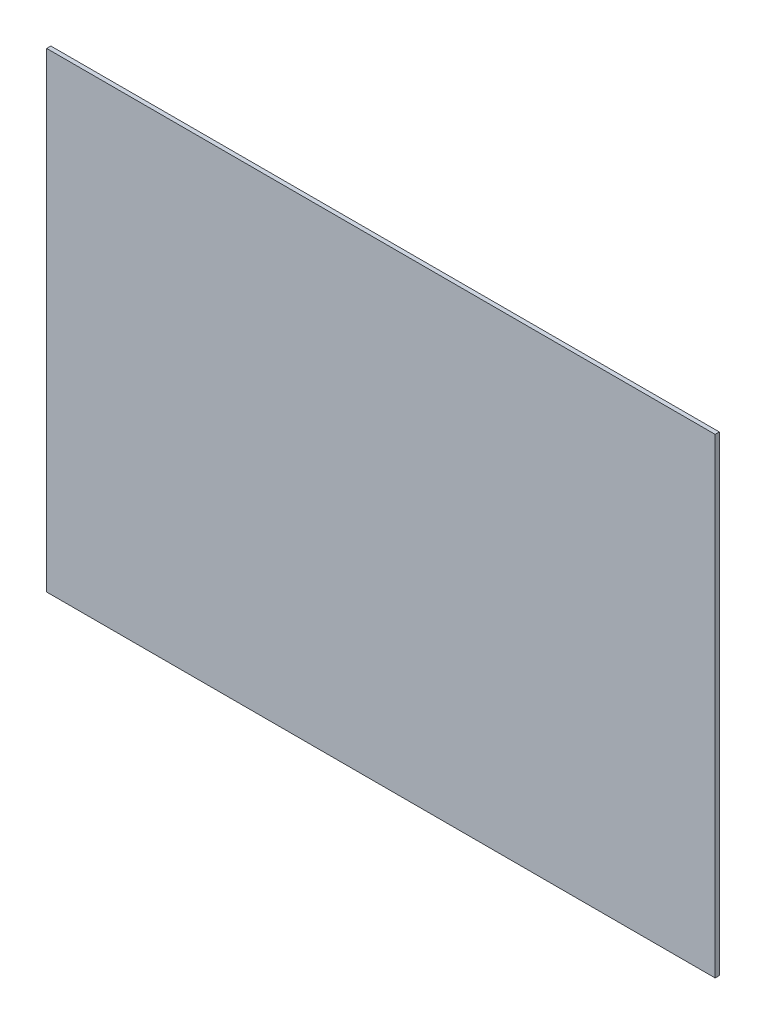
ISO-10303-21;
HEADER;
FILE_DESCRIPTION(('STEP AP214'),'2;1');
FILE_NAME('part.step','',(''),(''),'','','');
FILE_SCHEMA(('AUTOMOTIVE_DESIGN { 1 0 10303 214 1 1 1 1 }'));
ENDSEC;
DATA;
#1=APPLICATION_CONTEXT('core data for automotive mechanical design processes');
#2=APPLICATION_PROTOCOL_DEFINITION('international standard','automotive_design',2000,#1);
#3=PRODUCT_CONTEXT('',#1,'mechanical');
#4=PRODUCT('Part','Part','',(#3));
#5=PRODUCT_RELATED_PRODUCT_CATEGORY('part','',(#4));
#6=PRODUCT_DEFINITION_FORMATION('','',#4);
#7=PRODUCT_DEFINITION_CONTEXT('part definition',#1,'design');
#8=PRODUCT_DEFINITION('design','',#6,#7);
#9=PRODUCT_DEFINITION_SHAPE('','',#8);
#10=(LENGTH_UNIT() NAMED_UNIT(*) SI_UNIT(.MILLI.,.METRE.));
#11=(NAMED_UNIT(*) PLANE_ANGLE_UNIT() SI_UNIT($,.RADIAN.));
#12=(NAMED_UNIT(*) SI_UNIT($,.STERADIAN.) SOLID_ANGLE_UNIT());
#13=UNCERTAINTY_MEASURE_WITH_UNIT(LENGTH_MEASURE(1.E-05),#10,'distance_accuracy_value','');
#14=(GEOMETRIC_REPRESENTATION_CONTEXT(3) GLOBAL_UNCERTAINTY_ASSIGNED_CONTEXT((#13)) GLOBAL_UNIT_ASSIGNED_CONTEXT((#10,
#11,#12)) REPRESENTATION_CONTEXT('',''));
#15=CARTESIAN_POINT('',(0.,0.,0.));
#16=DIRECTION('',(0.,0.,1.));
#17=DIRECTION('',(1.,0.,0.));
#18=AXIS2_PLACEMENT_3D('',#15,#16,#17);
#19=CARTESIAN_POINT('',(-2.0262,1.427,0.0254));
#20=DIRECTION('',(1.,0.,0.));
#21=DIRECTION('',(0.,0.,-1.));
#22=AXIS2_PLACEMENT_3D('',#19,#20,#21);
#23=PLANE('',#22);
#24=DIRECTION('',(0.,-1.,0.));
#25=VECTOR('',#24,1.);
#26=CARTESIAN_POINT('',(-2.0262,1.427,0.));
#27=LINE('',#26,#25);
#28=CARTESIAN_POINT('',(-2.0262,1.427,0.));
#29=VERTEX_POINT('',#28);
#30=CARTESIAN_POINT('',(-2.0262,-1.427,0.));
#31=VERTEX_POINT('',#30);
#32=EDGE_CURVE('E100',#29,#31,#27,.T.);
#33=ORIENTED_EDGE('',*,*,#32,.T.);
#34=DIRECTION('',(0.,0.,-1.));
#35=VECTOR('',#34,1.);
#36=CARTESIAN_POINT('',(-2.0262,-1.427,0.0254));
#37=LINE('',#36,#35);
#38=CARTESIAN_POINT('',(-2.0262,-1.427,0.0254));
#39=VERTEX_POINT('',#38);
#40=EDGE_CURVE('E11',#39,#31,#37,.T.);
#41=ORIENTED_EDGE('',*,*,#40,.F.);
#42=DIRECTION('',(0.,-1.,0.));
#43=VECTOR('',#42,1.);
#44=CARTESIAN_POINT('',(-2.0262,1.427,0.0254));
#45=LINE('',#44,#43);
#46=CARTESIAN_POINT('',(-2.0262,1.427,0.0254));
#47=VERTEX_POINT('',#46);
#48=EDGE_CURVE('E88',#47,#39,#45,.T.);
#49=ORIENTED_EDGE('',*,*,#48,.F.);
#50=DIRECTION('',(0.,0.,-1.));
#51=VECTOR('',#50,1.);
#52=CARTESIAN_POINT('',(-2.0262,1.427,0.0254));
#53=LINE('',#52,#51);
#54=EDGE_CURVE('E96',#47,#29,#53,.T.);
#55=ORIENTED_EDGE('',*,*,#54,.T.);
#56=EDGE_LOOP('',(#33,#41,#49,#55));
#57=FACE_BOUND('',#56,.T.);
#58=ADVANCED_FACE('F37',(#57),#23,.F.);
#59=CARTESIAN_POINT('',(-2.0262,-1.427,0.0254));
#60=DIRECTION('',(0.,1.,0.));
#61=DIRECTION('',(0.,0.,1.));
#62=AXIS2_PLACEMENT_3D('',#59,#60,#61);
#63=PLANE('',#62);
#64=DIRECTION('',(1.,0.,0.));
#65=VECTOR('',#64,1.);
#66=CARTESIAN_POINT('',(-2.0262,-1.427,0.));
#67=LINE('',#66,#65);
#68=CARTESIAN_POINT('',(2.0262,-1.427,0.));
#69=VERTEX_POINT('',#68);
#70=EDGE_CURVE('E92',#31,#69,#67,.T.);
#71=ORIENTED_EDGE('',*,*,#70,.T.);
#72=DIRECTION('',(0.,0.,-1.));
#73=VECTOR('',#72,1.);
#74=CARTESIAN_POINT('',(2.0262,-1.427,0.0254));
#75=LINE('',#74,#73);
#76=CARTESIAN_POINT('',(2.0262,-1.427,0.0254));
#77=VERTEX_POINT('',#76);
#78=EDGE_CURVE('E45',#77,#69,#75,.T.);
#79=ORIENTED_EDGE('',*,*,#78,.F.);
#80=DIRECTION('',(1.,0.,0.));
#81=VECTOR('',#80,1.);
#82=CARTESIAN_POINT('',(-2.0262,-1.427,0.0254));
#83=LINE('',#82,#81);
#84=EDGE_CURVE('E83',#39,#77,#83,.T.);
#85=ORIENTED_EDGE('',*,*,#84,.F.);
#86=ORIENTED_EDGE('',*,*,#40,.T.);
#87=EDGE_LOOP('',(#71,#79,#85,#86));
#88=FACE_BOUND('',#87,.T.);
#89=ADVANCED_FACE('F91',(#88),#63,.F.);
#90=CARTESIAN_POINT('',(2.0262,-1.427,0.0254));
#91=DIRECTION('',(-1.,0.,0.));
#92=DIRECTION('',(0.,0.,1.));
#93=AXIS2_PLACEMENT_3D('',#90,#91,#92);
#94=PLANE('',#93);
#95=DIRECTION('',(0.,1.,0.));
#96=VECTOR('',#95,1.);
#97=CARTESIAN_POINT('',(2.0262,-1.427,0.));
#98=LINE('',#97,#96);
#99=CARTESIAN_POINT('',(2.0262,1.427,0.));
#100=VERTEX_POINT('',#99);
#101=EDGE_CURVE('E70',#69,#100,#98,.T.);
#102=ORIENTED_EDGE('',*,*,#101,.T.);
#103=DIRECTION('',(0.,0.,-1.));
#104=VECTOR('',#103,1.);
#105=CARTESIAN_POINT('',(2.0262,1.427,0.0254));
#106=LINE('',#105,#104);
#107=CARTESIAN_POINT('',(2.0262,1.427,0.0254));
#108=VERTEX_POINT('',#107);
#109=EDGE_CURVE('E93',#108,#100,#106,.T.);
#110=ORIENTED_EDGE('',*,*,#109,.F.);
#111=DIRECTION('',(0.,1.,0.));
#112=VECTOR('',#111,1.);
#113=CARTESIAN_POINT('',(2.0262,-1.427,0.0254));
#114=LINE('',#113,#112);
#115=EDGE_CURVE('E86',#77,#108,#114,.T.);
#116=ORIENTED_EDGE('',*,*,#115,.F.);
#117=ORIENTED_EDGE('',*,*,#78,.T.);
#118=EDGE_LOOP('',(#102,#110,#116,#117));
#119=FACE_BOUND('',#118,.T.);
#120=ADVANCED_FACE('F94',(#119),#94,.F.);
#121=CARTESIAN_POINT('',(2.0262,1.427,0.0254));
#122=DIRECTION('',(0.,-1.,0.));
#123=DIRECTION('',(0.,0.,-1.));
#124=AXIS2_PLACEMENT_3D('',#121,#122,#123);
#125=PLANE('',#124);
#126=DIRECTION('',(-1.,0.,0.));
#127=VECTOR('',#126,1.);
#128=CARTESIAN_POINT('',(2.0262,1.427,0.));
#129=LINE('',#128,#127);
#130=EDGE_CURVE('E76',#100,#29,#129,.T.);
#131=ORIENTED_EDGE('',*,*,#130,.T.);
#132=ORIENTED_EDGE('',*,*,#54,.F.);
#133=DIRECTION('',(-1.,0.,0.));
#134=VECTOR('',#133,1.);
#135=CARTESIAN_POINT('',(2.0262,1.427,0.0254));
#136=LINE('',#135,#134);
#137=EDGE_CURVE('E53',#108,#47,#136,.T.);
#138=ORIENTED_EDGE('',*,*,#137,.F.);
#139=ORIENTED_EDGE('',*,*,#109,.T.);
#140=EDGE_LOOP('',(#131,#132,#138,#139));
#141=FACE_BOUND('',#140,.T.);
#142=ADVANCED_FACE('F107',(#141),#125,.F.);
#143=CARTESIAN_POINT('',(0.,0.,0.0254));
#144=DIRECTION('',(0.,0.,1.));
#145=DIRECTION('',(1.,0.,0.));
#146=AXIS2_PLACEMENT_3D('',#143,#144,#145);
#147=PLANE('',#146);
#148=ORIENTED_EDGE('',*,*,#48,.T.);
#149=ORIENTED_EDGE('',*,*,#84,.T.);
#150=ORIENTED_EDGE('',*,*,#115,.T.);
#151=ORIENTED_EDGE('',*,*,#137,.T.);
#152=EDGE_LOOP('',(#148,#149,#150,#151));
#153=FACE_BOUND('',#152,.T.);
#154=ADVANCED_FACE('F84',(#153),#147,.T.);
#155=CARTESIAN_POINT('',(0.,0.,0.));
#156=DIRECTION('',(0.,0.,1.));
#157=DIRECTION('',(1.,0.,0.));
#158=AXIS2_PLACEMENT_3D('',#155,#156,#157);
#159=PLANE('',#158);
#160=ORIENTED_EDGE('',*,*,#32,.F.);
#161=ORIENTED_EDGE('',*,*,#130,.F.);
#162=ORIENTED_EDGE('',*,*,#101,.F.);
#163=ORIENTED_EDGE('',*,*,#70,.F.);
#164=EDGE_LOOP('',(#160,#161,#162,#163));
#165=FACE_BOUND('',#164,.T.);
#166=ADVANCED_FACE('F110',(#165),#159,.F.);
#167=CLOSED_SHELL('',(#58,#89,#120,#142,#154,#166));
#168=MANIFOLD_SOLID_BREP('B2',#167);
#169=ADVANCED_BREP_SHAPE_REPRESENTATION('',(#18,#168),#14);
#170=SHAPE_DEFINITION_REPRESENTATION(#9,#169);
ENDSEC;
END-ISO-10303-21;
